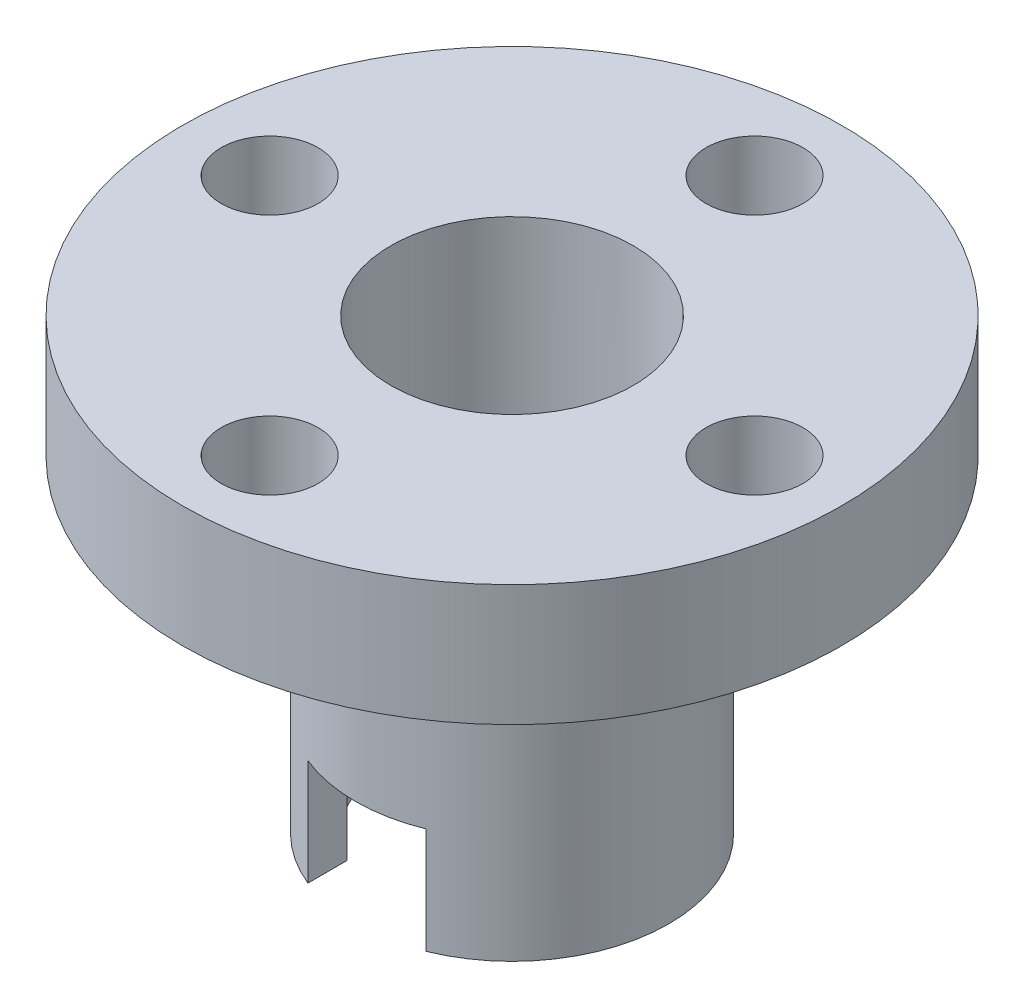
ISO-10303-21;
HEADER;
FILE_DESCRIPTION(('STEP AP214'),'2;1');
FILE_NAME('part.step','',(''),(''),'','','');
FILE_SCHEMA(('AUTOMOTIVE_DESIGN { 1 0 10303 214 1 1 1 1 }'));
ENDSEC;
DATA;
#1=APPLICATION_CONTEXT('core data for automotive mechanical design processes');
#2=APPLICATION_PROTOCOL_DEFINITION('international standard','automotive_design',2000,#1);
#3=PRODUCT_CONTEXT('',#1,'mechanical');
#4=PRODUCT('Part','Part','',(#3));
#5=PRODUCT_RELATED_PRODUCT_CATEGORY('part','',(#4));
#6=PRODUCT_DEFINITION_FORMATION('','',#4);
#7=PRODUCT_DEFINITION_CONTEXT('part definition',#1,'design');
#8=PRODUCT_DEFINITION('design','',#6,#7);
#9=PRODUCT_DEFINITION_SHAPE('','',#8);
#10=(LENGTH_UNIT() NAMED_UNIT(*) SI_UNIT(.MILLI.,.METRE.));
#11=(NAMED_UNIT(*) PLANE_ANGLE_UNIT() SI_UNIT($,.RADIAN.));
#12=(NAMED_UNIT(*) SI_UNIT($,.STERADIAN.) SOLID_ANGLE_UNIT());
#13=UNCERTAINTY_MEASURE_WITH_UNIT(LENGTH_MEASURE(1.E-05),#10,'distance_accuracy_value','');
#14=(GEOMETRIC_REPRESENTATION_CONTEXT(3) GLOBAL_UNCERTAINTY_ASSIGNED_CONTEXT((#13)) GLOBAL_UNIT_ASSIGNED_CONTEXT((#10,
#11,#12)) REPRESENTATION_CONTEXT('',''));
#15=CARTESIAN_POINT('',(0.,0.,0.));
#16=DIRECTION('',(0.,0.,1.));
#17=DIRECTION('',(1.,0.,0.));
#18=AXIS2_PLACEMENT_3D('',#15,#16,#17);
#19=CARTESIAN_POINT('',(0.,0.,0.));
#20=DIRECTION('',(0.,1.,0.));
#21=DIRECTION('',(0.,0.,1.));
#22=AXIS2_PLACEMENT_3D('',#19,#20,#21);
#23=PLANE('',#22);
#24=CARTESIAN_POINT('',(0.,0.,-8.));
#25=DIRECTION('',(0.,1.,0.));
#26=DIRECTION('',(0.,0.,1.));
#27=AXIS2_PLACEMENT_3D('',#24,#25,#26);
#28=CIRCLE('',#27,1.6);
#29=CARTESIAN_POINT('',(0.,0.,-6.4));
#30=VERTEX_POINT('',#29);
#31=EDGE_CURVE('E181',#30,#30,#28,.T.);
#32=ORIENTED_EDGE('',*,*,#31,.T.);
#33=EDGE_LOOP('',(#32));
#34=FACE_BOUND('',#33,.T.);
#35=CARTESIAN_POINT('',(0.,0.,8.));
#36=DIRECTION('',(0.,1.,0.));
#37=DIRECTION('',(0.,0.,1.));
#38=AXIS2_PLACEMENT_3D('',#35,#36,#37);
#39=CIRCLE('',#38,1.6);
#40=CARTESIAN_POINT('',(0.,0.,9.6));
#41=VERTEX_POINT('',#40);
#42=EDGE_CURVE('E185',#41,#41,#39,.T.);
#43=ORIENTED_EDGE('',*,*,#42,.T.);
#44=EDGE_LOOP('',(#43));
#45=FACE_BOUND('',#44,.T.);
#46=CARTESIAN_POINT('',(-8.,0.,0.));
#47=DIRECTION('',(0.,1.,0.));
#48=DIRECTION('',(0.,0.,1.));
#49=AXIS2_PLACEMENT_3D('',#46,#47,#48);
#50=CIRCLE('',#49,1.6);
#51=CARTESIAN_POINT('',(-8.,0.,1.6));
#52=VERTEX_POINT('',#51);
#53=EDGE_CURVE('E189',#52,#52,#50,.T.);
#54=ORIENTED_EDGE('',*,*,#53,.T.);
#55=EDGE_LOOP('',(#54));
#56=FACE_BOUND('',#55,.T.);
#57=CARTESIAN_POINT('',(8.,0.,0.));
#58=DIRECTION('',(0.,1.,0.));
#59=DIRECTION('',(0.,0.,1.));
#60=AXIS2_PLACEMENT_3D('',#57,#58,#59);
#61=CIRCLE('',#60,1.6);
#62=CARTESIAN_POINT('',(8.,0.,1.6));
#63=VERTEX_POINT('',#62);
#64=EDGE_CURVE('E192',#63,#63,#61,.T.);
#65=ORIENTED_EDGE('',*,*,#64,.T.);
#66=EDGE_LOOP('',(#65));
#67=FACE_BOUND('',#66,.T.);
#68=CARTESIAN_POINT('',(0.,0.,0.));
#69=DIRECTION('',(0.,-1.,0.));
#70=DIRECTION('',(0.,0.,-1.));
#71=AXIS2_PLACEMENT_3D('',#68,#69,#70);
#72=CIRCLE('',#71,5.17);
#73=CARTESIAN_POINT('',(0.,0.,-5.17));
#74=VERTEX_POINT('',#73);
#75=EDGE_CURVE('E177',#74,#74,#72,.T.);
#76=ORIENTED_EDGE('',*,*,#75,.F.);
#77=EDGE_LOOP('',(#76));
#78=FACE_BOUND('',#77,.T.);
#79=CARTESIAN_POINT('',(0.,0.,0.));
#80=DIRECTION('',(0.,1.,0.));
#81=DIRECTION('',(0.,0.,1.));
#82=AXIS2_PLACEMENT_3D('',#79,#80,#81);
#83=CIRCLE('',#82,10.875);
#84=CARTESIAN_POINT('',(0.,0.,10.875));
#85=VERTEX_POINT('',#84);
#86=EDGE_CURVE('E19',#85,#85,#83,.T.);
#87=ORIENTED_EDGE('',*,*,#86,.F.);
#88=EDGE_LOOP('',(#87));
#89=FACE_BOUND('',#88,.T.);
#90=ADVANCED_FACE('F16',(#34,#45,#56,#67,#78,#89),#23,.F.);
#91=CARTESIAN_POINT('',(0.,0.,0.));
#92=DIRECTION('',(0.,1.,0.));
#93=DIRECTION('',(0.,0.,1.));
#94=AXIS2_PLACEMENT_3D('',#91,#92,#93);
#95=CYLINDRICAL_SURFACE('',#94,10.875);
#96=ORIENTED_EDGE('',*,*,#86,.T.);
#97=EDGE_LOOP('',(#96));
#98=FACE_BOUND('',#97,.T.);
#99=CARTESIAN_POINT('',(0.,4.,0.));
#100=DIRECTION('',(0.,1.,0.));
#101=DIRECTION('',(0.,0.,1.));
#102=AXIS2_PLACEMENT_3D('',#99,#100,#101);
#103=CIRCLE('',#102,10.875);
#104=CARTESIAN_POINT('',(0.,4.,10.875));
#105=VERTEX_POINT('',#104);
#106=EDGE_CURVE('E173',#105,#105,#103,.T.);
#107=ORIENTED_EDGE('',*,*,#106,.F.);
#108=EDGE_LOOP('',(#107));
#109=FACE_BOUND('',#108,.T.);
#110=ADVANCED_FACE('F201',(#98,#109),#95,.T.);
#111=CARTESIAN_POINT('',(8.,-27.0181398539629,0.));
#112=DIRECTION('',(0.,1.,0.));
#113=DIRECTION('',(0.,0.,1.));
#114=AXIS2_PLACEMENT_3D('',#111,#112,#113);
#115=CYLINDRICAL_SURFACE('',#114,1.6);
#116=CARTESIAN_POINT('',(8.,4.,0.));
#117=DIRECTION('',(0.,1.,0.));
#118=DIRECTION('',(0.,0.,1.));
#119=AXIS2_PLACEMENT_3D('',#116,#117,#118);
#120=CIRCLE('',#119,1.6);
#121=CARTESIAN_POINT('',(8.,4.,1.6));
#122=VERTEX_POINT('',#121);
#123=EDGE_CURVE('E169',#122,#122,#120,.F.);
#124=ORIENTED_EDGE('',*,*,#123,.F.);
#125=EDGE_LOOP('',(#124));
#126=FACE_BOUND('',#125,.T.);
#127=ORIENTED_EDGE('',*,*,#64,.F.);
#128=EDGE_LOOP('',(#127));
#129=FACE_BOUND('',#128,.T.);
#130=ADVANCED_FACE('F211',(#126,#129),#115,.F.);
#131=CARTESIAN_POINT('',(-8.,-27.0181398539629,0.));
#132=DIRECTION('',(0.,1.,0.));
#133=DIRECTION('',(0.,0.,1.));
#134=AXIS2_PLACEMENT_3D('',#131,#132,#133);
#135=CYLINDRICAL_SURFACE('',#134,1.6);
#136=CARTESIAN_POINT('',(-8.,4.,0.));
#137=DIRECTION('',(0.,1.,0.));
#138=DIRECTION('',(0.,0.,1.));
#139=AXIS2_PLACEMENT_3D('',#136,#137,#138);
#140=CIRCLE('',#139,1.6);
#141=CARTESIAN_POINT('',(-8.,4.,1.6));
#142=VERTEX_POINT('',#141);
#143=EDGE_CURVE('E165',#142,#142,#140,.F.);
#144=ORIENTED_EDGE('',*,*,#143,.F.);
#145=EDGE_LOOP('',(#144));
#146=FACE_BOUND('',#145,.T.);
#147=ORIENTED_EDGE('',*,*,#53,.F.);
#148=EDGE_LOOP('',(#147));
#149=FACE_BOUND('',#148,.T.);
#150=ADVANCED_FACE('F261',(#146,#149),#135,.F.);
#151=CARTESIAN_POINT('',(0.,-27.0181398539629,8.));
#152=DIRECTION('',(0.,1.,0.));
#153=DIRECTION('',(0.,0.,1.));
#154=AXIS2_PLACEMENT_3D('',#151,#152,#153);
#155=CYLINDRICAL_SURFACE('',#154,1.6);
#156=CARTESIAN_POINT('',(0.,4.,8.));
#157=DIRECTION('',(0.,1.,0.));
#158=DIRECTION('',(0.,0.,1.));
#159=AXIS2_PLACEMENT_3D('',#156,#157,#158);
#160=CIRCLE('',#159,1.6);
#161=CARTESIAN_POINT('',(0.,4.,9.6));
#162=VERTEX_POINT('',#161);
#163=EDGE_CURVE('E161',#162,#162,#160,.F.);
#164=ORIENTED_EDGE('',*,*,#163,.F.);
#165=EDGE_LOOP('',(#164));
#166=FACE_BOUND('',#165,.T.);
#167=ORIENTED_EDGE('',*,*,#42,.F.);
#168=EDGE_LOOP('',(#167));
#169=FACE_BOUND('',#168,.T.);
#170=ADVANCED_FACE('F257',(#166,#169),#155,.F.);
#171=CARTESIAN_POINT('',(0.,-27.0181398539629,-8.));
#172=DIRECTION('',(0.,1.,0.));
#173=DIRECTION('',(0.,0.,1.));
#174=AXIS2_PLACEMENT_3D('',#171,#172,#173);
#175=CYLINDRICAL_SURFACE('',#174,1.6);
#176=CARTESIAN_POINT('',(0.,4.,-8.));
#177=DIRECTION('',(0.,1.,0.));
#178=DIRECTION('',(0.,0.,1.));
#179=AXIS2_PLACEMENT_3D('',#176,#177,#178);
#180=CIRCLE('',#179,1.6);
#181=CARTESIAN_POINT('',(0.,4.,-6.4));
#182=VERTEX_POINT('',#181);
#183=EDGE_CURVE('E100',#182,#182,#180,.F.);
#184=ORIENTED_EDGE('',*,*,#183,.F.);
#185=EDGE_LOOP('',(#184));
#186=FACE_BOUND('',#185,.T.);
#187=ORIENTED_EDGE('',*,*,#31,.F.);
#188=EDGE_LOOP('',(#187));
#189=FACE_BOUND('',#188,.T.);
#190=ADVANCED_FACE('F253',(#186,#189),#175,.F.);
#191=CARTESIAN_POINT('',(0.,0.,0.));
#192=DIRECTION('',(0.,-1.,0.));
#193=DIRECTION('',(0.,0.,-1.));
#194=AXIS2_PLACEMENT_3D('',#191,#192,#193);
#195=CYLINDRICAL_SURFACE('',#194,5.17);
#196=ORIENTED_EDGE('',*,*,#75,.T.);
#197=EDGE_LOOP('',(#196));
#198=FACE_BOUND('',#197,.T.);
#199=DIRECTION('',(0.,1.,0.));
#200=VECTOR('',#199,1.);
#201=CARTESIAN_POINT('',(1.95,-9.05,-4.78815204436952));
#202=LINE('',#201,#200);
#203=CARTESIAN_POINT('',(1.95,-10.8,-4.78815204436952));
#204=VERTEX_POINT('',#203);
#205=CARTESIAN_POINT('',(1.95,-7.3,-4.78815204436952));
#206=VERTEX_POINT('',#205);
#207=EDGE_CURVE('E119',#204,#206,#202,.T.);
#208=ORIENTED_EDGE('',*,*,#207,.T.);
#209=CARTESIAN_POINT('',(0.,-7.3,0.));
#210=DIRECTION('',(0.,-1.,0.));
#211=DIRECTION('',(0.,0.,-1.));
#212=AXIS2_PLACEMENT_3D('',#209,#210,#211);
#213=CIRCLE('',#212,5.17);
#214=CARTESIAN_POINT('',(-1.95,-7.3,-4.78815204436952));
#215=VERTEX_POINT('',#214);
#216=EDGE_CURVE('E109',#206,#215,#213,.F.);
#217=ORIENTED_EDGE('',*,*,#216,.T.);
#218=DIRECTION('',(0.,1.,0.));
#219=VECTOR('',#218,1.);
#220=CARTESIAN_POINT('',(-1.95,-9.05,-4.78815204436952));
#221=LINE('',#220,#219);
#222=CARTESIAN_POINT('',(-1.95,-10.8,-4.78815204436952));
#223=VERTEX_POINT('',#222);
#224=EDGE_CURVE('E103',#215,#223,#221,.F.);
#225=ORIENTED_EDGE('',*,*,#224,.T.);
#226=CARTESIAN_POINT('',(0.,-10.8,0.));
#227=DIRECTION('',(0.,-1.,0.));
#228=DIRECTION('',(0.,0.,-1.));
#229=AXIS2_PLACEMENT_3D('',#226,#227,#228);
#230=CIRCLE('',#229,5.17);
#231=CARTESIAN_POINT('',(-1.95,-10.8,4.78815204436952));
#232=VERTEX_POINT('',#231);
#233=EDGE_CURVE('E90',#223,#232,#230,.F.);
#234=ORIENTED_EDGE('',*,*,#233,.T.);
#235=DIRECTION('',(0.,1.,0.));
#236=VECTOR('',#235,1.);
#237=CARTESIAN_POINT('',(-1.95,-9.05,4.78815204436952));
#238=LINE('',#237,#236);
#239=CARTESIAN_POINT('',(-1.95,-7.3,4.78815204436952));
#240=VERTEX_POINT('',#239);
#241=EDGE_CURVE('E128',#232,#240,#238,.T.);
#242=ORIENTED_EDGE('',*,*,#241,.T.);
#243=CARTESIAN_POINT('',(0.,-7.3,0.));
#244=DIRECTION('',(0.,-1.,0.));
#245=DIRECTION('',(0.,0.,-1.));
#246=AXIS2_PLACEMENT_3D('',#243,#244,#245);
#247=CIRCLE('',#246,5.17);
#248=CARTESIAN_POINT('',(1.95,-7.3,4.78815204436952));
#249=VERTEX_POINT('',#248);
#250=EDGE_CURVE('E155',#240,#249,#247,.F.);
#251=ORIENTED_EDGE('',*,*,#250,.T.);
#252=DIRECTION('',(0.,1.,0.));
#253=VECTOR('',#252,1.);
#254=CARTESIAN_POINT('',(1.95,-9.05,4.78815204436952));
#255=LINE('',#254,#253);
#256=CARTESIAN_POINT('',(1.95,-10.8,4.78815204436952));
#257=VERTEX_POINT('',#256);
#258=EDGE_CURVE('E124',#249,#257,#255,.F.);
#259=ORIENTED_EDGE('',*,*,#258,.T.);
#260=CARTESIAN_POINT('',(0.,-10.8,0.));
#261=DIRECTION('',(0.,-1.,0.));
#262=DIRECTION('',(0.,0.,-1.));
#263=AXIS2_PLACEMENT_3D('',#260,#261,#262);
#264=CIRCLE('',#263,5.17);
#265=EDGE_CURVE('E152',#257,#204,#264,.F.);
#266=ORIENTED_EDGE('',*,*,#265,.T.);
#267=EDGE_LOOP('',(#208,#217,#225,#234,#242,#251,#259,#266));
#268=FACE_BOUND('',#267,.T.);
#269=ADVANCED_FACE('F107',(#198,#268),#195,.T.);
#270=CARTESIAN_POINT('',(0.,4.,0.));
#271=DIRECTION('',(0.,1.,0.));
#272=DIRECTION('',(0.,0.,1.));
#273=AXIS2_PLACEMENT_3D('',#270,#271,#272);
#274=PLANE('',#273);
#275=CARTESIAN_POINT('',(0.,4.,0.));
#276=DIRECTION('',(0.,1.,0.));
#277=DIRECTION('',(0.,0.,1.));
#278=AXIS2_PLACEMENT_3D('',#275,#276,#277);
#279=CIRCLE('',#278,4.);
#280=CARTESIAN_POINT('',(0.,4.,4.));
#281=VERTEX_POINT('',#280);
#282=EDGE_CURVE('E105',#281,#281,#279,.F.);
#283=ORIENTED_EDGE('',*,*,#282,.T.);
#284=EDGE_LOOP('',(#283));
#285=FACE_BOUND('',#284,.T.);
#286=ORIENTED_EDGE('',*,*,#183,.T.);
#287=EDGE_LOOP('',(#286));
#288=FACE_BOUND('',#287,.T.);
#289=ORIENTED_EDGE('',*,*,#163,.T.);
#290=EDGE_LOOP('',(#289));
#291=FACE_BOUND('',#290,.T.);
#292=ORIENTED_EDGE('',*,*,#143,.T.);
#293=EDGE_LOOP('',(#292));
#294=FACE_BOUND('',#293,.T.);
#295=ORIENTED_EDGE('',*,*,#123,.T.);
#296=EDGE_LOOP('',(#295));
#297=FACE_BOUND('',#296,.T.);
#298=ORIENTED_EDGE('',*,*,#106,.T.);
#299=EDGE_LOOP('',(#298));
#300=FACE_BOUND('',#299,.T.);
#301=ADVANCED_FACE('F248',(#285,#288,#291,#294,#297,#300),#274,.T.);
#302=CARTESIAN_POINT('',(0.,-10.8,0.));
#303=DIRECTION('',(0.,1.,0.));
#304=DIRECTION('',(0.,0.,1.));
#305=AXIS2_PLACEMENT_3D('',#302,#303,#304);
#306=PLANE('',#305);
#307=CARTESIAN_POINT('',(0.,-10.8,0.));
#308=DIRECTION('',(0.,1.,0.));
#309=DIRECTION('',(0.,0.,1.));
#310=AXIS2_PLACEMENT_3D('',#307,#308,#309);
#311=CIRCLE('',#310,4.);
#312=CARTESIAN_POINT('',(-1.95,-10.8,-3.49249194702006));
#313=VERTEX_POINT('',#312);
#314=CARTESIAN_POINT('',(-1.95,-10.8,3.49249194702006));
#315=VERTEX_POINT('',#314);
#316=EDGE_CURVE('E145',#313,#315,#311,.T.);
#317=ORIENTED_EDGE('',*,*,#316,.T.);
#318=DIRECTION('',(0.,0.,1.));
#319=VECTOR('',#318,1.);
#320=CARTESIAN_POINT('',(-1.95,-10.8,0.));
#321=LINE('',#320,#319);
#322=EDGE_CURVE('E95',#315,#232,#321,.T.);
#323=ORIENTED_EDGE('',*,*,#322,.T.);
#324=ORIENTED_EDGE('',*,*,#233,.F.);
#325=DIRECTION('',(0.,0.,1.));
#326=VECTOR('',#325,1.);
#327=CARTESIAN_POINT('',(-1.95,-10.8,0.));
#328=LINE('',#327,#326);
#329=EDGE_CURVE('E94',#223,#313,#328,.T.);
#330=ORIENTED_EDGE('',*,*,#329,.T.);
#331=EDGE_LOOP('',(#317,#323,#324,#330));
#332=FACE_BOUND('',#331,.T.);
#333=ADVANCED_FACE('F93',(#332),#306,.F.);
#334=CARTESIAN_POINT('',(-1.95,-9.05,0.));
#335=DIRECTION('',(-1.,0.,0.));
#336=DIRECTION('',(0.,0.,1.));
#337=AXIS2_PLACEMENT_3D('',#334,#335,#336);
#338=PLANE('',#337);
#339=DIRECTION('',(0.,0.,1.));
#340=VECTOR('',#339,1.);
#341=CARTESIAN_POINT('',(-1.95,-7.3,-5.17));
#342=LINE('',#341,#340);
#343=CARTESIAN_POINT('',(-1.95,-7.3,3.49249194702006));
#344=VERTEX_POINT('',#343);
#345=EDGE_CURVE('E131',#344,#240,#342,.T.);
#346=ORIENTED_EDGE('',*,*,#345,.T.);
#347=ORIENTED_EDGE('',*,*,#241,.F.);
#348=ORIENTED_EDGE('',*,*,#322,.F.);
#349=DIRECTION('',(0.,1.,0.));
#350=VECTOR('',#349,1.);
#351=CARTESIAN_POINT('',(-1.95,0.,3.49249194702006));
#352=LINE('',#351,#350);
#353=EDGE_CURVE('E144',#315,#344,#352,.T.);
#354=ORIENTED_EDGE('',*,*,#353,.T.);
#355=EDGE_LOOP('',(#346,#347,#348,#354));
#356=FACE_BOUND('',#355,.T.);
#357=ADVANCED_FACE('F241',(#356),#338,.F.);
#358=CARTESIAN_POINT('',(0.,-7.3,-5.17));
#359=DIRECTION('',(0.,1.,0.));
#360=DIRECTION('',(0.,0.,1.));
#361=AXIS2_PLACEMENT_3D('',#358,#359,#360);
#362=PLANE('',#361);
#363=DIRECTION('',(0.,0.,-1.));
#364=VECTOR('',#363,1.);
#365=CARTESIAN_POINT('',(1.95,-7.3,0.));
#366=LINE('',#365,#364);
#367=CARTESIAN_POINT('',(1.95,-7.3,3.49249194702006));
#368=VERTEX_POINT('',#367);
#369=EDGE_CURVE('E127',#368,#249,#366,.F.);
#370=ORIENTED_EDGE('',*,*,#369,.T.);
#371=ORIENTED_EDGE('',*,*,#250,.F.);
#372=ORIENTED_EDGE('',*,*,#345,.F.);
#373=CARTESIAN_POINT('',(0.,-7.3,0.));
#374=DIRECTION('',(0.,1.,0.));
#375=DIRECTION('',(0.,0.,1.));
#376=AXIS2_PLACEMENT_3D('',#373,#374,#375);
#377=CIRCLE('',#376,4.);
#378=EDGE_CURVE('E141',#344,#368,#377,.T.);
#379=ORIENTED_EDGE('',*,*,#378,.T.);
#380=EDGE_LOOP('',(#370,#371,#372,#379));
#381=FACE_BOUND('',#380,.T.);
#382=ADVANCED_FACE('F237',(#381),#362,.F.);
#383=CARTESIAN_POINT('',(1.95,-9.05,0.));
#384=DIRECTION('',(1.,0.,0.));
#385=DIRECTION('',(0.,0.,-1.));
#386=AXIS2_PLACEMENT_3D('',#383,#384,#385);
#387=PLANE('',#386);
#388=DIRECTION('',(0.,0.,1.));
#389=VECTOR('',#388,1.);
#390=CARTESIAN_POINT('',(1.95,-10.8,0.));
#391=LINE('',#390,#389);
#392=CARTESIAN_POINT('',(1.95,-10.8,3.49249194702006));
#393=VERTEX_POINT('',#392);
#394=EDGE_CURVE('E126',#393,#257,#391,.T.);
#395=ORIENTED_EDGE('',*,*,#394,.T.);
#396=ORIENTED_EDGE('',*,*,#258,.F.);
#397=ORIENTED_EDGE('',*,*,#369,.F.);
#398=DIRECTION('',(0.,1.,0.));
#399=VECTOR('',#398,1.);
#400=CARTESIAN_POINT('',(1.95,0.,3.49249194702006));
#401=LINE('',#400,#399);
#402=EDGE_CURVE('E140',#368,#393,#401,.F.);
#403=ORIENTED_EDGE('',*,*,#402,.T.);
#404=EDGE_LOOP('',(#395,#396,#397,#403));
#405=FACE_BOUND('',#404,.T.);
#406=ADVANCED_FACE('F233',(#405),#387,.F.);
#407=CARTESIAN_POINT('',(0.,-10.8,0.));
#408=DIRECTION('',(0.,1.,0.));
#409=DIRECTION('',(0.,0.,1.));
#410=AXIS2_PLACEMENT_3D('',#407,#408,#409);
#411=PLANE('',#410);
#412=ORIENTED_EDGE('',*,*,#265,.F.);
#413=ORIENTED_EDGE('',*,*,#394,.F.);
#414=CARTESIAN_POINT('',(0.,-10.8,0.));
#415=DIRECTION('',(0.,1.,0.));
#416=DIRECTION('',(0.,0.,1.));
#417=AXIS2_PLACEMENT_3D('',#414,#415,#416);
#418=CIRCLE('',#417,4.);
#419=CARTESIAN_POINT('',(1.95,-10.8,-3.49249194702006));
#420=VERTEX_POINT('',#419);
#421=EDGE_CURVE('E136',#393,#420,#418,.T.);
#422=ORIENTED_EDGE('',*,*,#421,.T.);
#423=DIRECTION('',(0.,0.,-1.));
#424=VECTOR('',#423,1.);
#425=CARTESIAN_POINT('',(1.95,-10.8,0.));
#426=LINE('',#425,#424);
#427=EDGE_CURVE('E123',#420,#204,#426,.T.);
#428=ORIENTED_EDGE('',*,*,#427,.T.);
#429=EDGE_LOOP('',(#412,#413,#422,#428));
#430=FACE_BOUND('',#429,.T.);
#431=ADVANCED_FACE('F229',(#430),#411,.F.);
#432=CARTESIAN_POINT('',(1.95,-9.05,0.));
#433=DIRECTION('',(1.,0.,0.));
#434=DIRECTION('',(0.,0.,-1.));
#435=AXIS2_PLACEMENT_3D('',#432,#433,#434);
#436=PLANE('',#435);
#437=DIRECTION('',(0.,0.,1.));
#438=VECTOR('',#437,1.);
#439=CARTESIAN_POINT('',(1.95,-7.3,-5.17));
#440=LINE('',#439,#438);
#441=CARTESIAN_POINT('',(1.95,-7.3,-3.49249194702006));
#442=VERTEX_POINT('',#441);
#443=EDGE_CURVE('E122',#442,#206,#440,.F.);
#444=ORIENTED_EDGE('',*,*,#443,.T.);
#445=ORIENTED_EDGE('',*,*,#207,.F.);
#446=ORIENTED_EDGE('',*,*,#427,.F.);
#447=DIRECTION('',(0.,1.,0.));
#448=VECTOR('',#447,1.);
#449=CARTESIAN_POINT('',(1.95,0.,-3.49249194702006));
#450=LINE('',#449,#448);
#451=EDGE_CURVE('E135',#420,#442,#450,.T.);
#452=ORIENTED_EDGE('',*,*,#451,.T.);
#453=EDGE_LOOP('',(#444,#445,#446,#452));
#454=FACE_BOUND('',#453,.T.);
#455=ADVANCED_FACE('F225',(#454),#436,.F.);
#456=CARTESIAN_POINT('',(0.,-7.3,-5.17));
#457=DIRECTION('',(0.,1.,0.));
#458=DIRECTION('',(0.,0.,1.));
#459=AXIS2_PLACEMENT_3D('',#456,#457,#458);
#460=PLANE('',#459);
#461=DIRECTION('',(0.,0.,1.));
#462=VECTOR('',#461,1.);
#463=CARTESIAN_POINT('',(-1.95,-7.3,0.));
#464=LINE('',#463,#462);
#465=CARTESIAN_POINT('',(-1.95,-7.3,-3.49249194702006));
#466=VERTEX_POINT('',#465);
#467=EDGE_CURVE('E38',#466,#215,#464,.F.);
#468=ORIENTED_EDGE('',*,*,#467,.T.);
#469=ORIENTED_EDGE('',*,*,#216,.F.);
#470=ORIENTED_EDGE('',*,*,#443,.F.);
#471=CARTESIAN_POINT('',(0.,-7.3,0.));
#472=DIRECTION('',(0.,1.,0.));
#473=DIRECTION('',(0.,0.,1.));
#474=AXIS2_PLACEMENT_3D('',#471,#472,#473);
#475=CIRCLE('',#474,4.);
#476=EDGE_CURVE('E26',#442,#466,#475,.T.);
#477=ORIENTED_EDGE('',*,*,#476,.T.);
#478=EDGE_LOOP('',(#468,#469,#470,#477));
#479=FACE_BOUND('',#478,.T.);
#480=ADVANCED_FACE('F218',(#479),#460,.F.);
#481=CARTESIAN_POINT('',(-1.95,-9.05,0.));
#482=DIRECTION('',(-1.,0.,0.));
#483=DIRECTION('',(0.,0.,1.));
#484=AXIS2_PLACEMENT_3D('',#481,#482,#483);
#485=PLANE('',#484);
#486=ORIENTED_EDGE('',*,*,#329,.F.);
#487=ORIENTED_EDGE('',*,*,#224,.F.);
#488=ORIENTED_EDGE('',*,*,#467,.F.);
#489=DIRECTION('',(0.,1.,0.));
#490=VECTOR('',#489,1.);
#491=CARTESIAN_POINT('',(-1.95,0.,-3.49249194702006));
#492=LINE('',#491,#490);
#493=EDGE_CURVE('E11',#466,#313,#492,.F.);
#494=ORIENTED_EDGE('',*,*,#493,.T.);
#495=EDGE_LOOP('',(#486,#487,#488,#494));
#496=FACE_BOUND('',#495,.T.);
#497=ADVANCED_FACE('F102',(#496),#485,.F.);
#498=CARTESIAN_POINT('',(0.,0.,0.));
#499=DIRECTION('',(0.,1.,0.));
#500=DIRECTION('',(0.,0.,1.));
#501=AXIS2_PLACEMENT_3D('',#498,#499,#500);
#502=CYLINDRICAL_SURFACE('',#501,4.);
#503=ORIENTED_EDGE('',*,*,#476,.F.);
#504=ORIENTED_EDGE('',*,*,#451,.F.);
#505=ORIENTED_EDGE('',*,*,#421,.F.);
#506=ORIENTED_EDGE('',*,*,#402,.F.);
#507=ORIENTED_EDGE('',*,*,#378,.F.);
#508=ORIENTED_EDGE('',*,*,#353,.F.);
#509=ORIENTED_EDGE('',*,*,#316,.F.);
#510=ORIENTED_EDGE('',*,*,#493,.F.);
#511=EDGE_LOOP('',(#503,#504,#505,#506,#507,#508,#509,#510));
#512=FACE_BOUND('',#511,.T.);
#513=ORIENTED_EDGE('',*,*,#282,.F.);
#514=EDGE_LOOP('',(#513));
#515=FACE_BOUND('',#514,.T.);
#516=ADVANCED_FACE('F213',(#512,#515),#502,.F.);
#517=CLOSED_SHELL('',(#90,#110,#130,#150,#170,#190,#269,#301,#333,#357,#382,#406,#431,#455,#480,
#497,#516));
#518=MANIFOLD_SOLID_BREP('B1',#517);
#519=ADVANCED_BREP_SHAPE_REPRESENTATION('',(#18,#518),#14);
#520=SHAPE_DEFINITION_REPRESENTATION(#9,#519);
ENDSEC;
END-ISO-10303-21;
